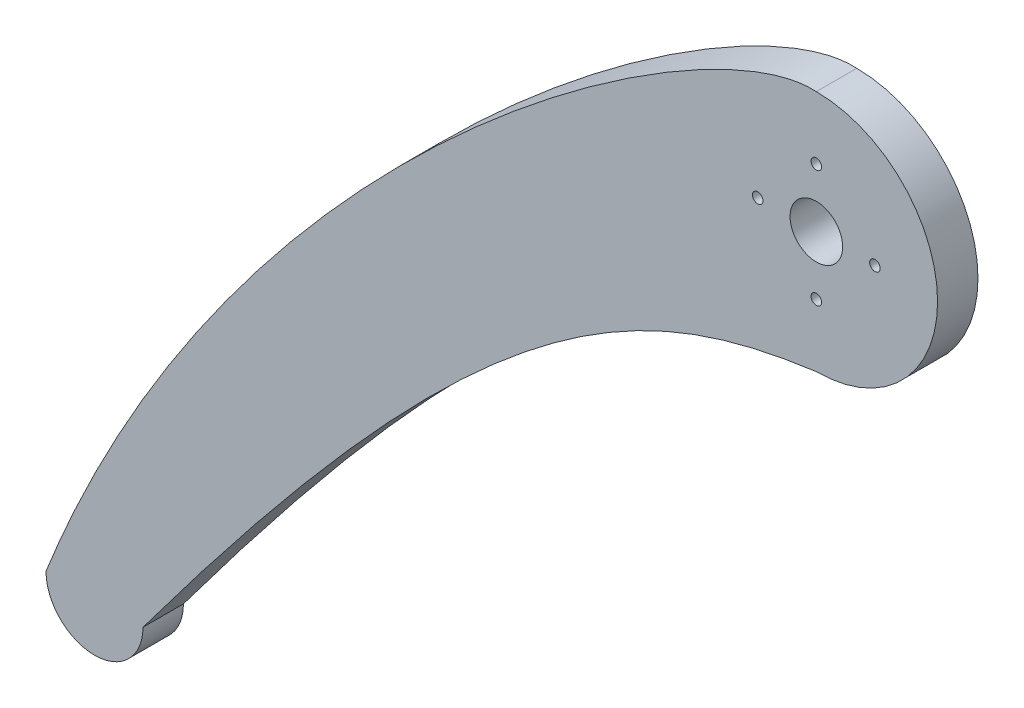
ISO-10303-21;
HEADER;
FILE_DESCRIPTION(('STEP AP214'),'2;1');
FILE_NAME('part.step','',(''),(''),'','','');
FILE_SCHEMA(('AUTOMOTIVE_DESIGN { 1 0 10303 214 1 1 1 1 }'));
ENDSEC;
DATA;
#1=APPLICATION_CONTEXT('core data for automotive mechanical design processes');
#2=APPLICATION_PROTOCOL_DEFINITION('international standard','automotive_design',2000,#1);
#3=PRODUCT_CONTEXT('',#1,'mechanical');
#4=PRODUCT('Part','Part','',(#3));
#5=PRODUCT_RELATED_PRODUCT_CATEGORY('part','',(#4));
#6=PRODUCT_DEFINITION_FORMATION('','',#4);
#7=PRODUCT_DEFINITION_CONTEXT('part definition',#1,'design');
#8=PRODUCT_DEFINITION('design','',#6,#7);
#9=PRODUCT_DEFINITION_SHAPE('','',#8);
#10=(LENGTH_UNIT() NAMED_UNIT(*) SI_UNIT(.MILLI.,.METRE.));
#11=(NAMED_UNIT(*) PLANE_ANGLE_UNIT() SI_UNIT($,.RADIAN.));
#12=(NAMED_UNIT(*) SI_UNIT($,.STERADIAN.) SOLID_ANGLE_UNIT());
#13=UNCERTAINTY_MEASURE_WITH_UNIT(LENGTH_MEASURE(1.E-05),#10,'distance_accuracy_value','');
#14=(GEOMETRIC_REPRESENTATION_CONTEXT(3) GLOBAL_UNCERTAINTY_ASSIGNED_CONTEXT((#13)) GLOBAL_UNIT_ASSIGNED_CONTEXT((#10,
#11,#12)) REPRESENTATION_CONTEXT('',''));
#15=CARTESIAN_POINT('',(0.,0.,0.));
#16=DIRECTION('',(0.,0.,1.));
#17=DIRECTION('',(1.,0.,0.));
#18=AXIS2_PLACEMENT_3D('',#15,#16,#17);
#19=CARTESIAN_POINT('',(0.,15.,5.));
#20=CARTESIAN_POINT('',(-14.2305839675521,15.9740144302134,5.));
#21=CARTESIAN_POINT('',(-71.54263477074,-23.8966732214863,5.));
#22=CARTESIAN_POINT('',(-95.2935548703715,-84.0243497769961,5.));
#23=B_SPLINE_CURVE_WITH_KNOTS('',3,(#19,#20,#21,#22),.UNSPECIFIED.,.F.,.F.,(4,4),(0.,1.),.UNSPECIFIED.);
#24=DIRECTION('',(0.,0.,-1.));
#25=VECTOR('',#24,1.);
#26=SURFACE_OF_LINEAR_EXTRUSION('',#23,#25);
#27=CARTESIAN_POINT('',(0.,15.,0.));
#28=CARTESIAN_POINT('',(-14.2305839675521,15.9740144302134,0.));
#29=CARTESIAN_POINT('',(-71.54263477074,-23.8966732214863,0.));
#30=CARTESIAN_POINT('',(-95.2935548703715,-84.0243497769961,0.));
#31=B_SPLINE_CURVE_WITH_KNOTS('',3,(#27,#28,#29,#30),.UNSPECIFIED.,.F.,.F.,(4,4),(0.,1.),.UNSPECIFIED.);
#32=CARTESIAN_POINT('',(0.,15.,0.));
#33=VERTEX_POINT('',#32);
#34=CARTESIAN_POINT('',(-95.2935548703715,-84.0243497769961,0.));
#35=VERTEX_POINT('',#34);
#36=EDGE_CURVE('E119',#33,#35,#31,.T.);
#37=ORIENTED_EDGE('',*,*,#36,.T.);
#38=DIRECTION('',(0.,0.,-1.));
#39=VECTOR('',#38,1.);
#40=CARTESIAN_POINT('',(-95.2935548703715,-84.0243497769961,5.));
#41=LINE('',#40,#39);
#42=CARTESIAN_POINT('',(-95.2935548703715,-84.0243497769961,5.));
#43=VERTEX_POINT('',#42);
#44=EDGE_CURVE('E11',#43,#35,#41,.T.);
#45=ORIENTED_EDGE('',*,*,#44,.F.);
#46=CARTESIAN_POINT('',(0.,15.,5.));
#47=VERTEX_POINT('',#46);
#48=EDGE_CURVE('E88',#47,#43,#23,.T.);
#49=ORIENTED_EDGE('',*,*,#48,.F.);
#50=DIRECTION('',(0.,0.,-1.));
#51=VECTOR('',#50,1.);
#52=CARTESIAN_POINT('',(0.,15.,5.));
#53=LINE('',#52,#51);
#54=EDGE_CURVE('E96',#47,#33,#53,.T.);
#55=ORIENTED_EDGE('',*,*,#54,.T.);
#56=EDGE_LOOP('',(#37,#45,#49,#55));
#57=FACE_BOUND('',#56,.T.);
#58=ADVANCED_FACE('F36',(#57),#26,.F.);
#59=CARTESIAN_POINT('',(-89.2935548698972,-84.0243497769961,5.));
#60=DIRECTION('',(0.,0.,-1.));
#61=DIRECTION('',(-1.,0.,0.));
#62=AXIS2_PLACEMENT_3D('',#59,#60,#61);
#63=CYLINDRICAL_SURFACE('',#62,6.00000000047432);
#64=CARTESIAN_POINT('',(-89.2935548698972,-84.0243497769961,0.));
#65=DIRECTION('',(0.,0.,1.));
#66=DIRECTION('',(1.,0.,0.));
#67=AXIS2_PLACEMENT_3D('',#64,#65,#66);
#68=CIRCLE('',#67,6.00000000047432);
#69=CARTESIAN_POINT('',(-83.2935548694229,-84.0243497769961,0.));
#70=VERTEX_POINT('',#69);
#71=EDGE_CURVE('E92',#35,#70,#68,.T.);
#72=ORIENTED_EDGE('',*,*,#71,.T.);
#73=DIRECTION('',(0.,0.,-1.));
#74=VECTOR('',#73,1.);
#75=CARTESIAN_POINT('',(-83.2935548694229,-84.0243497769961,5.));
#76=LINE('',#75,#74);
#77=CARTESIAN_POINT('',(-83.2935548694229,-84.0243497769961,5.));
#78=VERTEX_POINT('',#77);
#79=EDGE_CURVE('E45',#78,#70,#76,.T.);
#80=ORIENTED_EDGE('',*,*,#79,.F.);
#81=CARTESIAN_POINT('',(-89.2935548698972,-84.0243497769961,5.));
#82=DIRECTION('',(0.,0.,1.));
#83=DIRECTION('',(1.,0.,0.));
#84=AXIS2_PLACEMENT_3D('',#81,#82,#83);
#85=CIRCLE('',#84,6.00000000047432);
#86=EDGE_CURVE('E83',#43,#78,#85,.T.);
#87=ORIENTED_EDGE('',*,*,#86,.F.);
#88=ORIENTED_EDGE('',*,*,#44,.T.);
#89=EDGE_LOOP('',(#72,#80,#87,#88));
#90=FACE_BOUND('',#89,.T.);
#91=ADVANCED_FACE('F91',(#90),#63,.T.);
#92=CARTESIAN_POINT('',(-83.2935548694229,-84.0243497769961,5.));
#93=CARTESIAN_POINT('',(-40.9383554964222,-27.1903846559525,5.));
#94=CARTESIAN_POINT('',(-22.0420250829916,-17.9794656589536,5.));
#95=CARTESIAN_POINT('',(0.,-15.,5.));
#96=B_SPLINE_CURVE_WITH_KNOTS('',3,(#92,#93,#94,#95),.UNSPECIFIED.,.F.,.F.,(4,4),(0.,1.),.UNSPECIFIED.);
#97=DIRECTION('',(0.,0.,-1.));
#98=VECTOR('',#97,1.);
#99=SURFACE_OF_LINEAR_EXTRUSION('',#96,#98);
#100=CARTESIAN_POINT('',(-83.2935548694229,-84.0243497769961,0.));
#101=CARTESIAN_POINT('',(-40.9383554964222,-27.1903846559525,0.));
#102=CARTESIAN_POINT('',(-22.0420250829916,-17.9794656589536,0.));
#103=CARTESIAN_POINT('',(0.,-15.,0.));
#104=B_SPLINE_CURVE_WITH_KNOTS('',3,(#100,#101,#102,#103),.UNSPECIFIED.,.F.,.F.,(4,4),(0.,1.),.UNSPECIFIED.);
#105=CARTESIAN_POINT('',(0.,-15.,0.));
#106=VERTEX_POINT('',#105);
#107=EDGE_CURVE('E70',#70,#106,#104,.T.);
#108=ORIENTED_EDGE('',*,*,#107,.T.);
#109=DIRECTION('',(0.,0.,-1.));
#110=VECTOR('',#109,1.);
#111=CARTESIAN_POINT('',(0.,-15.,5.));
#112=LINE('',#111,#110);
#113=CARTESIAN_POINT('',(0.,-15.,5.));
#114=VERTEX_POINT('',#113);
#115=EDGE_CURVE('E93',#114,#106,#112,.T.);
#116=ORIENTED_EDGE('',*,*,#115,.F.);
#117=EDGE_CURVE('E86',#78,#114,#96,.T.);
#118=ORIENTED_EDGE('',*,*,#117,.F.);
#119=ORIENTED_EDGE('',*,*,#79,.T.);
#120=EDGE_LOOP('',(#108,#116,#118,#119));
#121=FACE_BOUND('',#120,.T.);
#122=ADVANCED_FACE('F94',(#121),#99,.F.);
#123=CARTESIAN_POINT('',(0.,0.,5.));
#124=DIRECTION('',(0.,0.,-1.));
#125=DIRECTION('',(-1.,0.,0.));
#126=AXIS2_PLACEMENT_3D('',#123,#124,#125);
#127=CYLINDRICAL_SURFACE('',#126,15.);
#128=CARTESIAN_POINT('',(0.,0.,0.));
#129=DIRECTION('',(0.,0.,1.));
#130=DIRECTION('',(1.,0.,0.));
#131=AXIS2_PLACEMENT_3D('',#128,#129,#130);
#132=CIRCLE('',#131,15.);
#133=EDGE_CURVE('E76',#106,#33,#132,.T.);
#134=ORIENTED_EDGE('',*,*,#133,.T.);
#135=ORIENTED_EDGE('',*,*,#54,.F.);
#136=CARTESIAN_POINT('',(0.,0.,5.));
#137=DIRECTION('',(0.,0.,1.));
#138=DIRECTION('',(1.,0.,0.));
#139=AXIS2_PLACEMENT_3D('',#136,#137,#138);
#140=CIRCLE('',#139,15.);
#141=EDGE_CURVE('E53',#114,#47,#140,.T.);
#142=ORIENTED_EDGE('',*,*,#141,.F.);
#143=ORIENTED_EDGE('',*,*,#115,.T.);
#144=EDGE_LOOP('',(#134,#135,#142,#143));
#145=FACE_BOUND('',#144,.T.);
#146=ADVANCED_FACE('F108',(#145),#127,.T.);
#147=CARTESIAN_POINT('',(-44.0766513856559,-11.5990407688518,5.));
#148=DIRECTION('',(0.,0.,-1.));
#149=DIRECTION('',(-1.,0.,0.));
#150=AXIS2_PLACEMENT_3D('',#147,#148,#149);
#151=PLANE('',#150);
#152=CARTESIAN_POINT('',(0.,7.25,5.));
#153=DIRECTION('',(0.,0.,1.));
#154=DIRECTION('',(1.,0.,0.));
#155=AXIS2_PLACEMENT_3D('',#152,#153,#154);
#156=CIRCLE('',#155,0.65);
#157=CARTESIAN_POINT('',(0.65,7.25,5.));
#158=VERTEX_POINT('',#157);
#159=EDGE_CURVE('E192',#158,#158,#156,.T.);
#160=ORIENTED_EDGE('',*,*,#159,.F.);
#161=EDGE_LOOP('',(#160));
#162=FACE_BOUND('',#161,.T.);
#163=CARTESIAN_POINT('',(-7.25,0.,5.));
#164=DIRECTION('',(0.,0.,1.));
#165=DIRECTION('',(1.,0.,0.));
#166=AXIS2_PLACEMENT_3D('',#163,#164,#165);
#167=CIRCLE('',#166,0.65);
#168=CARTESIAN_POINT('',(-6.6,0.,5.));
#169=VERTEX_POINT('',#168);
#170=EDGE_CURVE('E182',#169,#169,#167,.T.);
#171=ORIENTED_EDGE('',*,*,#170,.F.);
#172=EDGE_LOOP('',(#171));
#173=FACE_BOUND('',#172,.T.);
#174=CARTESIAN_POINT('',(0.,-7.25,5.));
#175=DIRECTION('',(0.,0.,1.));
#176=DIRECTION('',(1.,0.,0.));
#177=AXIS2_PLACEMENT_3D('',#174,#175,#176);
#178=CIRCLE('',#177,0.65);
#179=CARTESIAN_POINT('',(0.650000000000001,-7.25,5.));
#180=VERTEX_POINT('',#179);
#181=EDGE_CURVE('E178',#180,#180,#178,.T.);
#182=ORIENTED_EDGE('',*,*,#181,.F.);
#183=EDGE_LOOP('',(#182));
#184=FACE_BOUND('',#183,.T.);
#185=CARTESIAN_POINT('',(7.25,0.,5.));
#186=DIRECTION('',(0.,0.,1.));
#187=DIRECTION('',(1.,0.,0.));
#188=AXIS2_PLACEMENT_3D('',#185,#186,#187);
#189=CIRCLE('',#188,0.649999999999999);
#190=CARTESIAN_POINT('',(7.9,0.,5.));
#191=VERTEX_POINT('',#190);
#192=EDGE_CURVE('E185',#191,#191,#189,.T.);
#193=ORIENTED_EDGE('',*,*,#192,.F.);
#194=EDGE_LOOP('',(#193));
#195=FACE_BOUND('',#194,.T.);
#196=CARTESIAN_POINT('',(0.,0.,5.));
#197=DIRECTION('',(0.,0.,1.));
#198=DIRECTION('',(1.,0.,0.));
#199=AXIS2_PLACEMENT_3D('',#196,#197,#198);
#200=CIRCLE('',#199,3.25);
#201=CARTESIAN_POINT('',(3.25,0.,5.));
#202=VERTEX_POINT('',#201);
#203=EDGE_CURVE('E124',#202,#202,#200,.T.);
#204=ORIENTED_EDGE('',*,*,#203,.F.);
#205=EDGE_LOOP('',(#204));
#206=FACE_BOUND('',#205,.T.);
#207=ORIENTED_EDGE('',*,*,#48,.T.);
#208=ORIENTED_EDGE('',*,*,#86,.T.);
#209=ORIENTED_EDGE('',*,*,#117,.T.);
#210=ORIENTED_EDGE('',*,*,#141,.T.);
#211=EDGE_LOOP('',(#207,#208,#209,#210));
#212=FACE_BOUND('',#211,.T.);
#213=ADVANCED_FACE('F84',(#162,#173,#184,#195,#206,#212),#151,.F.);
#214=CARTESIAN_POINT('',(-44.0766513856559,-11.5990407688518,0.));
#215=DIRECTION('',(0.,0.,-1.));
#216=DIRECTION('',(-1.,0.,0.));
#217=AXIS2_PLACEMENT_3D('',#214,#215,#216);
#218=PLANE('',#217);
#219=CARTESIAN_POINT('',(0.,7.25,0.));
#220=DIRECTION('',(0.,0.,1.));
#221=DIRECTION('',(1.,0.,0.));
#222=AXIS2_PLACEMENT_3D('',#219,#220,#221);
#223=CIRCLE('',#222,0.65);
#224=CARTESIAN_POINT('',(0.65,7.25,0.));
#225=VERTEX_POINT('',#224);
#226=EDGE_CURVE('E190',#225,#225,#223,.T.);
#227=ORIENTED_EDGE('',*,*,#226,.T.);
#228=EDGE_LOOP('',(#227));
#229=FACE_BOUND('',#228,.T.);
#230=CARTESIAN_POINT('',(-7.25,0.,0.));
#231=DIRECTION('',(0.,0.,1.));
#232=DIRECTION('',(1.,0.,0.));
#233=AXIS2_PLACEMENT_3D('',#230,#231,#232);
#234=CIRCLE('',#233,0.65);
#235=CARTESIAN_POINT('',(-6.6,0.,0.));
#236=VERTEX_POINT('',#235);
#237=EDGE_CURVE('E195',#236,#236,#234,.T.);
#238=ORIENTED_EDGE('',*,*,#237,.T.);
#239=EDGE_LOOP('',(#238));
#240=FACE_BOUND('',#239,.T.);
#241=CARTESIAN_POINT('',(0.,-7.25,0.));
#242=DIRECTION('',(0.,0.,1.));
#243=DIRECTION('',(1.,0.,0.));
#244=AXIS2_PLACEMENT_3D('',#241,#242,#243);
#245=CIRCLE('',#244,0.65);
#246=CARTESIAN_POINT('',(0.650000000000001,-7.25,0.));
#247=VERTEX_POINT('',#246);
#248=EDGE_CURVE('E175',#247,#247,#245,.T.);
#249=ORIENTED_EDGE('',*,*,#248,.T.);
#250=EDGE_LOOP('',(#249));
#251=FACE_BOUND('',#250,.T.);
#252=CARTESIAN_POINT('',(7.25,0.,0.));
#253=DIRECTION('',(0.,0.,1.));
#254=DIRECTION('',(1.,0.,0.));
#255=AXIS2_PLACEMENT_3D('',#252,#253,#254);
#256=CIRCLE('',#255,0.649999999999999);
#257=CARTESIAN_POINT('',(7.9,0.,0.));
#258=VERTEX_POINT('',#257);
#259=EDGE_CURVE('E180',#258,#258,#256,.T.);
#260=ORIENTED_EDGE('',*,*,#259,.T.);
#261=EDGE_LOOP('',(#260));
#262=FACE_BOUND('',#261,.T.);
#263=CARTESIAN_POINT('',(0.,0.,0.));
#264=DIRECTION('',(0.,0.,1.));
#265=DIRECTION('',(1.,0.,0.));
#266=AXIS2_PLACEMENT_3D('',#263,#264,#265);
#267=CIRCLE('',#266,3.25);
#268=CARTESIAN_POINT('',(3.25,0.,0.));
#269=VERTEX_POINT('',#268);
#270=EDGE_CURVE('E121',#269,#269,#267,.T.);
#271=ORIENTED_EDGE('',*,*,#270,.T.);
#272=EDGE_LOOP('',(#271));
#273=FACE_BOUND('',#272,.T.);
#274=ORIENTED_EDGE('',*,*,#36,.F.);
#275=ORIENTED_EDGE('',*,*,#133,.F.);
#276=ORIENTED_EDGE('',*,*,#107,.F.);
#277=ORIENTED_EDGE('',*,*,#71,.F.);
#278=EDGE_LOOP('',(#274,#275,#276,#277));
#279=FACE_BOUND('',#278,.T.);
#280=ADVANCED_FACE('F140',(#229,#240,#251,#262,#273,#279),#218,.T.);
#281=CARTESIAN_POINT('',(0.,0.,0.));
#282=DIRECTION('',(0.,0.,1.));
#283=DIRECTION('',(1.,0.,0.));
#284=AXIS2_PLACEMENT_3D('',#281,#282,#283);
#285=CYLINDRICAL_SURFACE('',#284,3.25);
#286=ORIENTED_EDGE('',*,*,#270,.F.);
#287=EDGE_LOOP('',(#286));
#288=FACE_BOUND('',#287,.T.);
#289=ORIENTED_EDGE('',*,*,#203,.T.);
#290=EDGE_LOOP('',(#289));
#291=FACE_BOUND('',#290,.T.);
#292=ADVANCED_FACE('F142',(#288,#291),#285,.F.);
#293=CARTESIAN_POINT('',(7.25,0.,0.));
#294=DIRECTION('',(0.,0.,1.));
#295=DIRECTION('',(1.,0.,0.));
#296=AXIS2_PLACEMENT_3D('',#293,#294,#295);
#297=CYLINDRICAL_SURFACE('',#296,0.649999999999999);
#298=ORIENTED_EDGE('',*,*,#259,.F.);
#299=EDGE_LOOP('',(#298));
#300=FACE_BOUND('',#299,.T.);
#301=ORIENTED_EDGE('',*,*,#192,.T.);
#302=EDGE_LOOP('',(#301));
#303=FACE_BOUND('',#302,.T.);
#304=ADVANCED_FACE('F148',(#300,#303),#297,.F.);
#305=CARTESIAN_POINT('',(0.,-7.25,0.));
#306=DIRECTION('',(0.,0.,1.));
#307=DIRECTION('',(1.,0.,0.));
#308=AXIS2_PLACEMENT_3D('',#305,#306,#307);
#309=CYLINDRICAL_SURFACE('',#308,0.65);
#310=ORIENTED_EDGE('',*,*,#248,.F.);
#311=EDGE_LOOP('',(#310));
#312=FACE_BOUND('',#311,.T.);
#313=ORIENTED_EDGE('',*,*,#181,.T.);
#314=EDGE_LOOP('',(#313));
#315=FACE_BOUND('',#314,.T.);
#316=ADVANCED_FACE('F160',(#312,#315),#309,.F.);
#317=CARTESIAN_POINT('',(-7.25,0.,0.));
#318=DIRECTION('',(0.,0.,1.));
#319=DIRECTION('',(1.,0.,0.));
#320=AXIS2_PLACEMENT_3D('',#317,#318,#319);
#321=CYLINDRICAL_SURFACE('',#320,0.65);
#322=ORIENTED_EDGE('',*,*,#237,.F.);
#323=EDGE_LOOP('',(#322));
#324=FACE_BOUND('',#323,.T.);
#325=ORIENTED_EDGE('',*,*,#170,.T.);
#326=EDGE_LOOP('',(#325));
#327=FACE_BOUND('',#326,.T.);
#328=ADVANCED_FACE('F156',(#324,#327),#321,.F.);
#329=CARTESIAN_POINT('',(0.,7.25,0.));
#330=DIRECTION('',(0.,0.,1.));
#331=DIRECTION('',(1.,0.,0.));
#332=AXIS2_PLACEMENT_3D('',#329,#330,#331);
#333=CYLINDRICAL_SURFACE('',#332,0.65);
#334=ORIENTED_EDGE('',*,*,#226,.F.);
#335=EDGE_LOOP('',(#334));
#336=FACE_BOUND('',#335,.T.);
#337=ORIENTED_EDGE('',*,*,#159,.T.);
#338=EDGE_LOOP('',(#337));
#339=FACE_BOUND('',#338,.T.);
#340=ADVANCED_FACE('F159',(#336,#339),#333,.F.);
#341=CLOSED_SHELL('',(#58,#91,#122,#146,#213,#280,#292,#304,#316,#328,#340));
#342=MANIFOLD_SOLID_BREP('B2',#341);
#343=ADVANCED_BREP_SHAPE_REPRESENTATION('',(#18,#342),#14);
#344=SHAPE_DEFINITION_REPRESENTATION(#9,#343);
ENDSEC;
END-ISO-10303-21;
